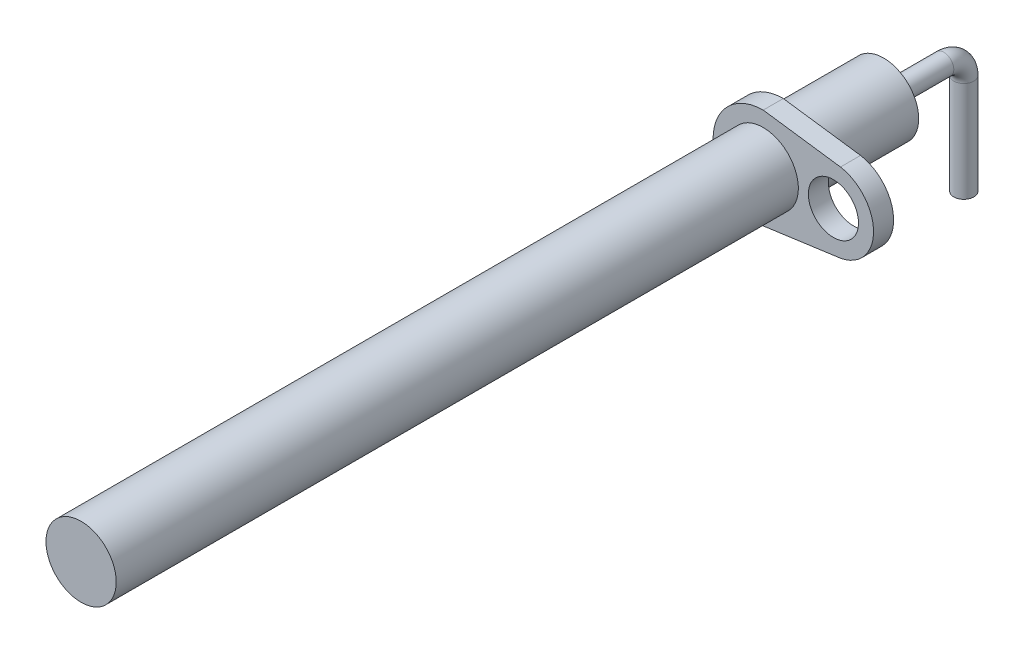
ISO-10303-21;
HEADER;
FILE_DESCRIPTION(('STEP AP214'),'2;1');
FILE_NAME('part.step','',(''),(''),'','','');
FILE_SCHEMA(('AUTOMOTIVE_DESIGN { 1 0 10303 214 1 1 1 1 }'));
ENDSEC;
DATA;
#1=APPLICATION_CONTEXT('core data for automotive mechanical design processes');
#2=APPLICATION_PROTOCOL_DEFINITION('international standard','automotive_design',2000,#1);
#3=PRODUCT_CONTEXT('',#1,'mechanical');
#4=PRODUCT('Part','Part','',(#3));
#5=PRODUCT_RELATED_PRODUCT_CATEGORY('part','',(#4));
#6=PRODUCT_DEFINITION_FORMATION('','',#4);
#7=PRODUCT_DEFINITION_CONTEXT('part definition',#1,'design');
#8=PRODUCT_DEFINITION('design','',#6,#7);
#9=PRODUCT_DEFINITION_SHAPE('','',#8);
#10=(LENGTH_UNIT() NAMED_UNIT(*) SI_UNIT(.MILLI.,.METRE.));
#11=(NAMED_UNIT(*) PLANE_ANGLE_UNIT() SI_UNIT($,.RADIAN.));
#12=(NAMED_UNIT(*) SI_UNIT($,.STERADIAN.) SOLID_ANGLE_UNIT());
#13=UNCERTAINTY_MEASURE_WITH_UNIT(LENGTH_MEASURE(1.E-05),#10,'distance_accuracy_value','');
#14=(GEOMETRIC_REPRESENTATION_CONTEXT(3) GLOBAL_UNCERTAINTY_ASSIGNED_CONTEXT((#13)) GLOBAL_UNIT_ASSIGNED_CONTEXT((#10,
#11,#12)) REPRESENTATION_CONTEXT('',''));
#15=CARTESIAN_POINT('',(0.,0.,0.));
#16=DIRECTION('',(0.,0.,1.));
#17=DIRECTION('',(1.,0.,0.));
#18=AXIS2_PLACEMENT_3D('',#15,#16,#17);
#19=CARTESIAN_POINT('',(0.,0.,40.));
#20=DIRECTION('',(0.,0.,-1.));
#21=DIRECTION('',(-1.,0.,0.));
#22=AXIS2_PLACEMENT_3D('',#19,#20,#21);
#23=CYLINDRICAL_SURFACE('',#22,1.75);
#24=CARTESIAN_POINT('',(0.,0.,5.));
#25=DIRECTION('',(0.,0.,-1.));
#26=DIRECTION('',(-1.,0.,0.));
#27=AXIS2_PLACEMENT_3D('',#24,#25,#26);
#28=CIRCLE('',#27,1.75);
#29=CARTESIAN_POINT('',(-1.75,0.,5.));
#30=VERTEX_POINT('',#29);
#31=EDGE_CURVE('E50',#30,#30,#28,.T.);
#32=ORIENTED_EDGE('',*,*,#31,.T.);
#33=EDGE_LOOP('',(#32));
#34=FACE_BOUND('',#33,.T.);
#35=CARTESIAN_POINT('',(0.,0.,0.));
#36=DIRECTION('',(0.,0.,1.));
#37=DIRECTION('',(1.,0.,0.));
#38=AXIS2_PLACEMENT_3D('',#35,#36,#37);
#39=CIRCLE('',#38,1.75);
#40=CARTESIAN_POINT('',(1.75,0.,0.));
#41=VERTEX_POINT('',#40);
#42=EDGE_CURVE('E132',#41,#41,#39,.T.);
#43=ORIENTED_EDGE('',*,*,#42,.T.);
#44=EDGE_LOOP('',(#43));
#45=FACE_BOUND('',#44,.T.);
#46=ADVANCED_FACE('F47',(#34,#45),#23,.T.);
#47=CARTESIAN_POINT('',(0.,0.,0.));
#48=DIRECTION('',(0.,0.,1.));
#49=DIRECTION('',(1.,0.,0.));
#50=AXIS2_PLACEMENT_3D('',#47,#48,#49);
#51=PLANE('',#50);
#52=CARTESIAN_POINT('',(0.,0.,0.));
#53=DIRECTION('',(0.,0.,1.));
#54=DIRECTION('',(-1.,0.,0.));
#55=AXIS2_PLACEMENT_3D('',#52,#53,#54);
#56=CIRCLE('',#55,0.5);
#57=CARTESIAN_POINT('',(-0.5,0.,0.));
#58=VERTEX_POINT('',#57);
#59=EDGE_CURVE('E122',#58,#58,#56,.T.);
#60=ORIENTED_EDGE('',*,*,#59,.T.);
#61=EDGE_LOOP('',(#60));
#62=FACE_BOUND('',#61,.T.);
#63=ORIENTED_EDGE('',*,*,#42,.F.);
#64=EDGE_LOOP('',(#63));
#65=FACE_BOUND('',#64,.T.);
#66=ADVANCED_FACE('F139',(#62,#65),#51,.F.);
#67=CARTESIAN_POINT('',(0.,-6.,-4.));
#68=DIRECTION('',(0.,1.,0.));
#69=DIRECTION('',(-1.,0.,0.));
#70=AXIS2_PLACEMENT_3D('',#67,#68,#69);
#71=PLANE('',#70);
#72=CARTESIAN_POINT('',(0.,-6.,-4.));
#73=DIRECTION('',(0.,1.,0.));
#74=DIRECTION('',(-1.,0.,0.));
#75=AXIS2_PLACEMENT_3D('',#72,#73,#74);
#76=CIRCLE('',#75,0.5);
#77=CARTESIAN_POINT('',(-0.500000000000001,-6.,-4.));
#78=VERTEX_POINT('',#77);
#79=EDGE_CURVE('E60',#78,#78,#76,.T.);
#80=ORIENTED_EDGE('',*,*,#79,.F.);
#81=EDGE_LOOP('',(#80));
#82=FACE_BOUND('',#81,.T.);
#83=ADVANCED_FACE('F141',(#82),#71,.F.);
#84=CARTESIAN_POINT('',(0.,0.,0.));
#85=DIRECTION('',(0.,0.,-1.));
#86=DIRECTION('',(-1.,0.,0.));
#87=AXIS2_PLACEMENT_3D('',#84,#85,#86);
#88=CYLINDRICAL_SURFACE('',#87,0.5);
#89=CARTESIAN_POINT('',(0.,0.,-2.99999999999999));
#90=DIRECTION('',(0.,0.,1.));
#91=DIRECTION('',(-1.,0.,0.));
#92=AXIS2_PLACEMENT_3D('',#89,#90,#91);
#93=CIRCLE('',#92,0.5);
#94=CARTESIAN_POINT('',(0.,0.5,-2.99999999999999));
#95=VERTEX_POINT('',#94);
#96=EDGE_CURVE('E125',#95,#95,#93,.T.);
#97=ORIENTED_EDGE('',*,*,#96,.T.);
#98=EDGE_LOOP('',(#97));
#99=FACE_BOUND('',#98,.T.);
#100=ORIENTED_EDGE('',*,*,#59,.F.);
#101=EDGE_LOOP('',(#100));
#102=FACE_BOUND('',#101,.T.);
#103=ADVANCED_FACE('F148',(#99,#102),#88,.T.);
#104=CARTESIAN_POINT('',(0.,-1.,-3.));
#105=DIRECTION('',(-1.,0.,0.));
#106=DIRECTION('',(0.,-1.,0.));
#107=AXIS2_PLACEMENT_3D('',#104,#105,#106);
#108=TOROIDAL_SURFACE('',#107,1.,0.5);
#109=CARTESIAN_POINT('',(0.,-0.999999999999979,-4.00000000000004));
#110=DIRECTION('',(0.,1.,0.));
#111=DIRECTION('',(-1.,0.,0.));
#112=AXIS2_PLACEMENT_3D('',#109,#110,#111);
#113=CIRCLE('',#112,0.5);
#114=CARTESIAN_POINT('',(0.,-0.999999999999969,-4.5));
#115=VERTEX_POINT('',#114);
#116=EDGE_CURVE('E128',#115,#115,#113,.T.);
#117=CARTESIAN_POINT('',(0.,-1.,-3.));
#118=DIRECTION('',(-1.,0.,0.));
#119=DIRECTION('',(0.,-1.,0.));
#120=AXIS2_PLACEMENT_3D('',#117,#118,#119);
#121=CIRCLE('',#120,1.5);
#122=EDGE_CURVE('',#95,#115,#121,.T.);
#123=ORIENTED_EDGE('',*,*,#96,.F.);
#124=ORIENTED_EDGE('',*,*,#116,.T.);
#125=ORIENTED_EDGE('',*,*,#122,.T.);
#126=ORIENTED_EDGE('',*,*,#122,.F.);
#127=EDGE_LOOP('',(#123,#125,#124,#126));
#128=FACE_BOUND('',#127,.T.);
#129=ADVANCED_FACE('F156',(#128),#108,.T.);
#130=CARTESIAN_POINT('',(0.,-1.00000000000001,-4.));
#131=DIRECTION('',(0.,-1.,0.));
#132=DIRECTION('',(1.,0.,0.));
#133=AXIS2_PLACEMENT_3D('',#130,#131,#132);
#134=CYLINDRICAL_SURFACE('',#133,0.5);
#135=ORIENTED_EDGE('',*,*,#79,.T.);
#136=EDGE_LOOP('',(#135));
#137=FACE_BOUND('',#136,.T.);
#138=ORIENTED_EDGE('',*,*,#116,.F.);
#139=EDGE_LOOP('',(#138));
#140=FACE_BOUND('',#139,.T.);
#141=ADVANCED_FACE('F143',(#137,#140),#134,.T.);
#142=CARTESIAN_POINT('',(0.338323179704949,2.4533442674789,5.));
#143=DIRECTION('',(0.136610003324938,0.990624907314348,0.));
#144=DIRECTION('',(-0.990624907314348,0.136610003324938,0.));
#145=AXIS2_PLACEMENT_3D('',#142,#143,#144);
#146=PLANE('',#145);
#147=DIRECTION('',(-0.990624907314348,0.136610003324938,0.));
#148=VECTOR('',#147,1.);
#149=CARTESIAN_POINT('',(0.338323179704949,2.4533442674789,6.));
#150=LINE('',#149,#148);
#151=CARTESIAN_POINT('',(3.85156177106147,1.96885863411473,6.));
#152=VERTEX_POINT('',#151);
#153=CARTESIAN_POINT('',(0.,2.5,6.));
#154=VERTEX_POINT('',#153);
#155=EDGE_CURVE('E187',#152,#154,#150,.T.);
#156=ORIENTED_EDGE('',*,*,#155,.F.);
#157=DIRECTION('',(0.,0.,1.));
#158=VECTOR('',#157,1.);
#159=CARTESIAN_POINT('',(3.85156177106147,1.96885863411473,5.));
#160=LINE('',#159,#158);
#161=CARTESIAN_POINT('',(3.85156177106147,1.96885863411473,5.));
#162=VERTEX_POINT('',#161);
#163=EDGE_CURVE('E90',#162,#152,#160,.T.);
#164=ORIENTED_EDGE('',*,*,#163,.F.);
#165=DIRECTION('',(-0.990624907314348,0.136610003324938,0.));
#166=VECTOR('',#165,1.);
#167=CARTESIAN_POINT('',(0.338323179704949,2.4533442674789,5.));
#168=LINE('',#167,#166);
#169=CARTESIAN_POINT('',(0.,2.5,5.));
#170=VERTEX_POINT('',#169);
#171=EDGE_CURVE('E111',#162,#170,#168,.T.);
#172=ORIENTED_EDGE('',*,*,#171,.T.);
#173=DIRECTION('',(0.,0.,1.));
#174=VECTOR('',#173,1.);
#175=CARTESIAN_POINT('',(0.,2.5,5.));
#176=LINE('',#175,#174);
#177=EDGE_CURVE('E68',#170,#154,#176,.T.);
#178=ORIENTED_EDGE('',*,*,#177,.T.);
#179=EDGE_LOOP('',(#156,#164,#172,#178));
#180=FACE_BOUND('',#179,.T.);
#181=ADVANCED_FACE('F151',(#180),#146,.T.);
#182=CARTESIAN_POINT('',(3.5,0.,5.));
#183=DIRECTION('',(0.,0.,1.));
#184=DIRECTION('',(1.,0.,0.));
#185=AXIS2_PLACEMENT_3D('',#182,#183,#184);
#186=CYLINDRICAL_SURFACE('',#185,2.);
#187=CARTESIAN_POINT('',(3.5,0.,6.));
#188=DIRECTION('',(0.,0.,-1.));
#189=DIRECTION('',(-1.,0.,0.));
#190=AXIS2_PLACEMENT_3D('',#187,#188,#189);
#191=CIRCLE('',#190,2.);
#192=CARTESIAN_POINT('',(3.85156177106147,-1.96885863411473,6.));
#193=VERTEX_POINT('',#192);
#194=EDGE_CURVE('E116',#152,#193,#191,.T.);
#195=ORIENTED_EDGE('',*,*,#194,.T.);
#196=DIRECTION('',(0.,0.,1.));
#197=VECTOR('',#196,1.);
#198=CARTESIAN_POINT('',(3.85156177106147,-1.96885863411473,5.));
#199=LINE('',#198,#197);
#200=CARTESIAN_POINT('',(3.85156177106147,-1.96885863411473,5.));
#201=VERTEX_POINT('',#200);
#202=EDGE_CURVE('E101',#201,#193,#199,.T.);
#203=ORIENTED_EDGE('',*,*,#202,.F.);
#204=CARTESIAN_POINT('',(3.5,0.,5.));
#205=DIRECTION('',(0.,0.,-1.));
#206=DIRECTION('',(-1.,0.,0.));
#207=AXIS2_PLACEMENT_3D('',#204,#205,#206);
#208=CIRCLE('',#207,2.);
#209=EDGE_CURVE('E107',#162,#201,#208,.T.);
#210=ORIENTED_EDGE('',*,*,#209,.F.);
#211=ORIENTED_EDGE('',*,*,#163,.T.);
#212=EDGE_LOOP('',(#195,#203,#210,#211));
#213=FACE_BOUND('',#212,.T.);
#214=ADVANCED_FACE('F114',(#213),#186,.T.);
#215=CARTESIAN_POINT('',(0.338323179704949,-2.4533442674789,5.));
#216=DIRECTION('',(-0.136610003324938,0.990624907314348,0.));
#217=DIRECTION('',(-0.990624907314348,-0.136610003324938,0.));
#218=AXIS2_PLACEMENT_3D('',#215,#216,#217);
#219=PLANE('',#218);
#220=DIRECTION('',(-0.990624907314348,-0.136610003324938,0.));
#221=VECTOR('',#220,1.);
#222=CARTESIAN_POINT('',(0.338323179704949,-2.4533442674789,6.));
#223=LINE('',#222,#221);
#224=CARTESIAN_POINT('',(0.,-2.5,6.));
#225=VERTEX_POINT('',#224);
#226=EDGE_CURVE('E192',#193,#225,#223,.T.);
#227=ORIENTED_EDGE('',*,*,#226,.T.);
#228=DIRECTION('',(0.,0.,1.));
#229=VECTOR('',#228,1.);
#230=CARTESIAN_POINT('',(0.,-2.5,5.));
#231=LINE('',#230,#229);
#232=CARTESIAN_POINT('',(0.,-2.5,5.));
#233=VERTEX_POINT('',#232);
#234=EDGE_CURVE('E103',#233,#225,#231,.T.);
#235=ORIENTED_EDGE('',*,*,#234,.F.);
#236=DIRECTION('',(-0.990624907314348,-0.136610003324938,0.));
#237=VECTOR('',#236,1.);
#238=CARTESIAN_POINT('',(0.338323179704949,-2.4533442674789,5.));
#239=LINE('',#238,#237);
#240=EDGE_CURVE('E96',#201,#233,#239,.T.);
#241=ORIENTED_EDGE('',*,*,#240,.F.);
#242=ORIENTED_EDGE('',*,*,#202,.T.);
#243=EDGE_LOOP('',(#227,#235,#241,#242));
#244=FACE_BOUND('',#243,.T.);
#245=ADVANCED_FACE('F99',(#244),#219,.F.);
#246=CARTESIAN_POINT('',(3.5,0.,5.));
#247=DIRECTION('',(0.,0.,1.));
#248=DIRECTION('',(1.,0.,0.));
#249=AXIS2_PLACEMENT_3D('',#246,#247,#248);
#250=CYLINDRICAL_SURFACE('',#249,1.25);
#251=CARTESIAN_POINT('',(3.5,0.,5.));
#252=DIRECTION('',(0.,0.,-1.));
#253=DIRECTION('',(-1.,0.,0.));
#254=AXIS2_PLACEMENT_3D('',#251,#252,#253);
#255=CIRCLE('',#254,1.25);
#256=CARTESIAN_POINT('',(2.25,0.,5.));
#257=VERTEX_POINT('',#256);
#258=EDGE_CURVE('E191',#257,#257,#255,.T.);
#259=ORIENTED_EDGE('',*,*,#258,.T.);
#260=EDGE_LOOP('',(#259));
#261=FACE_BOUND('',#260,.T.);
#262=CARTESIAN_POINT('',(3.5,0.,6.));
#263=DIRECTION('',(0.,0.,-1.));
#264=DIRECTION('',(-1.,0.,0.));
#265=AXIS2_PLACEMENT_3D('',#262,#263,#264);
#266=CIRCLE('',#265,1.25);
#267=CARTESIAN_POINT('',(2.25,0.,6.));
#268=VERTEX_POINT('',#267);
#269=EDGE_CURVE('E185',#268,#268,#266,.T.);
#270=ORIENTED_EDGE('',*,*,#269,.F.);
#271=EDGE_LOOP('',(#270));
#272=FACE_BOUND('',#271,.T.);
#273=ADVANCED_FACE('F203',(#261,#272),#250,.F.);
#274=CARTESIAN_POINT('',(0.,0.,5.));
#275=DIRECTION('',(0.,0.,1.));
#276=DIRECTION('',(1.,0.,0.));
#277=AXIS2_PLACEMENT_3D('',#274,#275,#276);
#278=CYLINDRICAL_SURFACE('',#277,2.5);
#279=CARTESIAN_POINT('',(0.,0.,6.));
#280=DIRECTION('',(0.,0.,-1.));
#281=DIRECTION('',(-1.,0.,0.));
#282=AXIS2_PLACEMENT_3D('',#279,#280,#281);
#283=CIRCLE('',#282,2.5);
#284=EDGE_CURVE('E188',#154,#225,#283,.F.);
#285=ORIENTED_EDGE('',*,*,#284,.F.);
#286=ORIENTED_EDGE('',*,*,#177,.F.);
#287=CARTESIAN_POINT('',(0.,0.,5.));
#288=DIRECTION('',(0.,0.,-1.));
#289=DIRECTION('',(-1.,0.,0.));
#290=AXIS2_PLACEMENT_3D('',#287,#288,#289);
#291=CIRCLE('',#290,2.5);
#292=EDGE_CURVE('E106',#170,#233,#291,.F.);
#293=ORIENTED_EDGE('',*,*,#292,.T.);
#294=ORIENTED_EDGE('',*,*,#234,.T.);
#295=EDGE_LOOP('',(#285,#286,#293,#294));
#296=FACE_BOUND('',#295,.T.);
#297=ADVANCED_FACE('F190',(#296),#278,.T.);
#298=CARTESIAN_POINT('',(0.,0.,5.));
#299=DIRECTION('',(0.,0.,-1.));
#300=DIRECTION('',(-1.,0.,0.));
#301=AXIS2_PLACEMENT_3D('',#298,#299,#300);
#302=PLANE('',#301);
#303=ORIENTED_EDGE('',*,*,#31,.F.);
#304=EDGE_LOOP('',(#303));
#305=FACE_BOUND('',#304,.T.);
#306=ORIENTED_EDGE('',*,*,#258,.F.);
#307=EDGE_LOOP('',(#306));
#308=FACE_BOUND('',#307,.T.);
#309=ORIENTED_EDGE('',*,*,#171,.F.);
#310=ORIENTED_EDGE('',*,*,#209,.T.);
#311=ORIENTED_EDGE('',*,*,#240,.T.);
#312=ORIENTED_EDGE('',*,*,#292,.F.);
#313=EDGE_LOOP('',(#309,#310,#311,#312));
#314=FACE_BOUND('',#313,.T.);
#315=ADVANCED_FACE('F110',(#305,#308,#314),#302,.T.);
#316=CARTESIAN_POINT('',(0.,0.,6.));
#317=DIRECTION('',(0.,0.,-1.));
#318=DIRECTION('',(-1.,0.,0.));
#319=AXIS2_PLACEMENT_3D('',#316,#317,#318);
#320=PLANE('',#319);
#321=CARTESIAN_POINT('',(0.,0.,6.));
#322=DIRECTION('',(0.,0.,-1.));
#323=DIRECTION('',(-1.,0.,0.));
#324=AXIS2_PLACEMENT_3D('',#321,#322,#323);
#325=CIRCLE('',#324,1.75);
#326=CARTESIAN_POINT('',(-1.75,0.,6.));
#327=VERTEX_POINT('',#326);
#328=EDGE_CURVE('E12',#327,#327,#325,.T.);
#329=ORIENTED_EDGE('',*,*,#328,.T.);
#330=EDGE_LOOP('',(#329));
#331=FACE_BOUND('',#330,.T.);
#332=ORIENTED_EDGE('',*,*,#269,.T.);
#333=EDGE_LOOP('',(#332));
#334=FACE_BOUND('',#333,.T.);
#335=ORIENTED_EDGE('',*,*,#155,.T.);
#336=ORIENTED_EDGE('',*,*,#284,.T.);
#337=ORIENTED_EDGE('',*,*,#226,.F.);
#338=ORIENTED_EDGE('',*,*,#194,.F.);
#339=EDGE_LOOP('',(#335,#336,#337,#338));
#340=FACE_BOUND('',#339,.T.);
#341=ADVANCED_FACE('F169',(#331,#334,#340),#320,.F.);
#342=CARTESIAN_POINT('',(0.,0.,40.));
#343=DIRECTION('',(0.,0.,1.));
#344=DIRECTION('',(1.,0.,0.));
#345=AXIS2_PLACEMENT_3D('',#342,#343,#344);
#346=PLANE('',#345);
#347=CARTESIAN_POINT('',(0.,0.,40.));
#348=DIRECTION('',(0.,0.,1.));
#349=DIRECTION('',(1.,0.,0.));
#350=AXIS2_PLACEMENT_3D('',#347,#348,#349);
#351=CIRCLE('',#350,1.75);
#352=CARTESIAN_POINT('',(1.75,0.,40.));
#353=VERTEX_POINT('',#352);
#354=EDGE_CURVE('E55',#353,#353,#351,.T.);
#355=ORIENTED_EDGE('',*,*,#354,.T.);
#356=EDGE_LOOP('',(#355));
#357=FACE_BOUND('',#356,.T.);
#358=ADVANCED_FACE('F167',(#357),#346,.T.);
#359=ORIENTED_EDGE('',*,*,#354,.F.);
#360=EDGE_LOOP('',(#359));
#361=FACE_BOUND('',#360,.T.);
#362=ORIENTED_EDGE('',*,*,#328,.F.);
#363=EDGE_LOOP('',(#362));
#364=FACE_BOUND('',#363,.T.);
#365=ADVANCED_FACE('F153',(#361,#364),#23,.T.);
#366=CLOSED_SHELL('',(#46,#66,#83,#103,#129,#141,#181,#214,#245,#273,#297,#315,#341,#358,#365));
#367=MANIFOLD_SOLID_BREP('B2',#366);
#368=ADVANCED_BREP_SHAPE_REPRESENTATION('',(#18,#367),#14);
#369=SHAPE_DEFINITION_REPRESENTATION(#9,#368);
ENDSEC;
END-ISO-10303-21;
